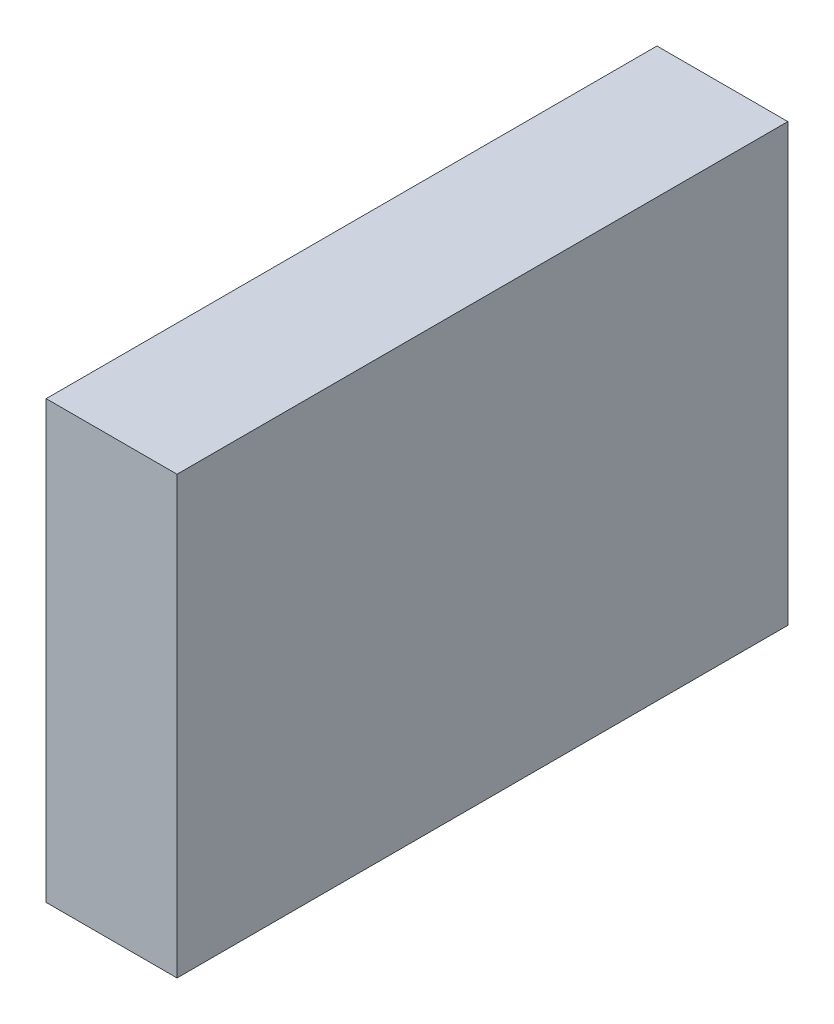
ISO-10303-21;
HEADER;
FILE_DESCRIPTION(('STEP AP214'),'2;1');
FILE_NAME('part.step','',(''),(''),'','','');
FILE_SCHEMA(('AUTOMOTIVE_DESIGN { 1 0 10303 214 1 1 1 1 }'));
ENDSEC;
DATA;
#1=APPLICATION_CONTEXT('core data for automotive mechanical design processes');
#2=APPLICATION_PROTOCOL_DEFINITION('international standard','automotive_design',2000,#1);
#3=PRODUCT_CONTEXT('',#1,'mechanical');
#4=PRODUCT('Part','Part','',(#3));
#5=PRODUCT_RELATED_PRODUCT_CATEGORY('part','',(#4));
#6=PRODUCT_DEFINITION_FORMATION('','',#4);
#7=PRODUCT_DEFINITION_CONTEXT('part definition',#1,'design');
#8=PRODUCT_DEFINITION('design','',#6,#7);
#9=PRODUCT_DEFINITION_SHAPE('','',#8);
#10=(LENGTH_UNIT() NAMED_UNIT(*) SI_UNIT(.MILLI.,.METRE.));
#11=(NAMED_UNIT(*) PLANE_ANGLE_UNIT() SI_UNIT($,.RADIAN.));
#12=(NAMED_UNIT(*) SI_UNIT($,.STERADIAN.) SOLID_ANGLE_UNIT());
#13=UNCERTAINTY_MEASURE_WITH_UNIT(LENGTH_MEASURE(1.E-05),#10,'distance_accuracy_value','');
#14=(GEOMETRIC_REPRESENTATION_CONTEXT(3) GLOBAL_UNCERTAINTY_ASSIGNED_CONTEXT((#13)) GLOBAL_UNIT_ASSIGNED_CONTEXT((#10,
#11,#12)) REPRESENTATION_CONTEXT('',''));
#15=CARTESIAN_POINT('',(0.,0.,0.));
#16=DIRECTION('',(0.,0.,1.));
#17=DIRECTION('',(1.,0.,0.));
#18=AXIS2_PLACEMENT_3D('',#15,#16,#17);
#19=CARTESIAN_POINT('',(-3.,0.679999822530764,-3.72112146154861));
#20=DIRECTION('',(1.,0.,0.));
#21=DIRECTION('',(0.,1.,8.74227765734759E-08));
#22=AXIS2_PLACEMENT_3D('',#19,#20,#21);
#23=PLANE('',#22);
#24=DIRECTION('',(0.,0.999999999999996,8.74227765733007E-08));
#25=VECTOR('',#24,1.);
#26=CARTESIAN_POINT('',(-3.,0.749999816410169,-3.65112145542901));
#27=LINE('',#26,#25);
#28=CARTESIAN_POINT('',(-3.,0.749999816411169,-3.65112145542901));
#29=VERTEX_POINT('',#28);
#30=CARTESIAN_POINT('',(-3.,1.74999981641217,-3.65112136800523));
#31=VERTEX_POINT('',#30);
#32=EDGE_CURVE('E11',#29,#31,#27,.T.);
#33=ORIENTED_EDGE('',*,*,#32,.T.);
#34=DIRECTION('',(0.,-8.74227764783136E-08,0.999999999999996));
#35=VECTOR('',#34,1.);
#36=CARTESIAN_POINT('',(-3.,1.74999981641217,-3.65112136800623));
#37=LINE('',#36,#35);
#38=CARTESIAN_POINT('',(-3.,1.74999969401928,-2.25112136800623));
#39=VERTEX_POINT('',#38);
#40=EDGE_CURVE('E69',#31,#39,#37,.T.);
#41=ORIENTED_EDGE('',*,*,#40,.T.);
#42=DIRECTION('',(0.,-0.999999999999996,-8.74227765733007E-08));
#43=VECTOR('',#42,1.);
#44=CARTESIAN_POINT('',(-3.,1.74999969402028,-2.25112136800623));
#45=LINE('',#44,#43);
#46=CARTESIAN_POINT('',(-3.,0.749999694018282,-2.25112145543001));
#47=VERTEX_POINT('',#46);
#48=EDGE_CURVE('E55',#39,#47,#45,.T.);
#49=ORIENTED_EDGE('',*,*,#48,.T.);
#50=DIRECTION('',(0.,8.74227765576152E-08,-0.999999999999996));
#51=VECTOR('',#50,1.);
#52=CARTESIAN_POINT('',(-3.,0.749999694018282,-2.25112145542901));
#53=LINE('',#52,#51);
#54=EDGE_CURVE('E53',#47,#29,#53,.T.);
#55=ORIENTED_EDGE('',*,*,#54,.T.);
#56=EDGE_LOOP('',(#33,#41,#49,#55));
#57=FACE_BOUND('',#56,.T.);
#58=ADVANCED_FACE('F17',(#57),#23,.T.);
#59=CARTESIAN_POINT('',(-3.3,0.679999822530764,-3.72112146154861));
#60=DIRECTION('',(1.,0.,0.));
#61=DIRECTION('',(0.,1.,8.74227765734759E-08));
#62=AXIS2_PLACEMENT_3D('',#59,#60,#61);
#63=PLANE('',#62);
#64=DIRECTION('',(0.,8.74227765576152E-08,-0.999999999999996));
#65=VECTOR('',#64,1.);
#66=CARTESIAN_POINT('',(-3.3,0.749999694018282,-2.25112145542901));
#67=LINE('',#66,#65);
#68=CARTESIAN_POINT('',(-3.3,0.749999694018282,-2.25112145543001));
#69=VERTEX_POINT('',#68);
#70=CARTESIAN_POINT('',(-3.3,0.749999816411169,-3.65112145542901));
#71=VERTEX_POINT('',#70);
#72=EDGE_CURVE('E24',#69,#71,#67,.T.);
#73=ORIENTED_EDGE('',*,*,#72,.F.);
#74=DIRECTION('',(0.,-0.999999999999996,-8.74227765733007E-08));
#75=VECTOR('',#74,1.);
#76=CARTESIAN_POINT('',(-3.3,1.74999969402028,-2.25112136800623));
#77=LINE('',#76,#75);
#78=CARTESIAN_POINT('',(-3.3,1.74999969401928,-2.25112136800623));
#79=VERTEX_POINT('',#78);
#80=EDGE_CURVE('E70',#79,#69,#77,.T.);
#81=ORIENTED_EDGE('',*,*,#80,.F.);
#82=DIRECTION('',(0.,-8.74227766369168E-08,0.999999999999996));
#83=VECTOR('',#82,1.);
#84=CARTESIAN_POINT('',(-3.3,1.74999981641217,-3.65112136800624));
#85=LINE('',#84,#83);
#86=CARTESIAN_POINT('',(-3.3,1.74999981641217,-3.65112136800523));
#87=VERTEX_POINT('',#86);
#88=EDGE_CURVE('E59',#87,#79,#85,.T.);
#89=ORIENTED_EDGE('',*,*,#88,.F.);
#90=DIRECTION('',(0.,0.999999999999996,8.74227765733007E-08));
#91=VECTOR('',#90,1.);
#92=CARTESIAN_POINT('',(-3.3,0.749999816410169,-3.65112145542901));
#93=LINE('',#92,#91);
#94=EDGE_CURVE('E78',#71,#87,#93,.T.);
#95=ORIENTED_EDGE('',*,*,#94,.F.);
#96=EDGE_LOOP('',(#73,#81,#89,#95));
#97=FACE_BOUND('',#96,.T.);
#98=ADVANCED_FACE('F89',(#97),#63,.F.);
#99=CARTESIAN_POINT('',(-3.,0.749999816410169,-3.65112145542901));
#100=DIRECTION('',(0.,-8.74227765734759E-08,1.));
#101=DIRECTION('',(0.,1.,8.74227765734759E-08));
#102=AXIS2_PLACEMENT_3D('',#99,#100,#101);
#103=PLANE('',#102);
#104=DIRECTION('',(-1.,0.,0.));
#105=VECTOR('',#104,1.);
#106=CARTESIAN_POINT('',(-3.,0.749999816410169,-3.65112145542901));
#107=LINE('',#106,#105);
#108=EDGE_CURVE('E65',#29,#71,#107,.T.);
#109=ORIENTED_EDGE('',*,*,#108,.T.);
#110=ORIENTED_EDGE('',*,*,#94,.T.);
#111=DIRECTION('',(-1.,0.,0.));
#112=VECTOR('',#111,1.);
#113=CARTESIAN_POINT('',(-3.,1.74999981641217,-3.65112136800624));
#114=LINE('',#113,#112);
#115=EDGE_CURVE('E66',#31,#87,#114,.T.);
#116=ORIENTED_EDGE('',*,*,#115,.F.);
#117=ORIENTED_EDGE('',*,*,#32,.F.);
#118=EDGE_LOOP('',(#109,#110,#116,#117));
#119=FACE_BOUND('',#118,.T.);
#120=ADVANCED_FACE('F63',(#119),#103,.F.);
#121=CARTESIAN_POINT('',(-3.,1.74999981641217,-3.65112136800623));
#122=DIRECTION('',(0.,-1.,-8.74227765734759E-08));
#123=DIRECTION('',(0.,-8.74227765734759E-08,1.));
#124=AXIS2_PLACEMENT_3D('',#121,#122,#123);
#125=PLANE('',#124);
#126=ORIENTED_EDGE('',*,*,#115,.T.);
#127=ORIENTED_EDGE('',*,*,#88,.T.);
#128=DIRECTION('',(-1.,0.,0.));
#129=VECTOR('',#128,1.);
#130=CARTESIAN_POINT('',(-3.,1.74999969402028,-2.25112136800623));
#131=LINE('',#130,#129);
#132=EDGE_CURVE('E60',#39,#79,#131,.T.);
#133=ORIENTED_EDGE('',*,*,#132,.F.);
#134=ORIENTED_EDGE('',*,*,#40,.F.);
#135=EDGE_LOOP('',(#126,#127,#133,#134));
#136=FACE_BOUND('',#135,.T.);
#137=ADVANCED_FACE('F91',(#136),#125,.F.);
#138=CARTESIAN_POINT('',(-3.,1.74999969402028,-2.25112136800623));
#139=DIRECTION('',(0.,8.74227765734759E-08,-1.));
#140=DIRECTION('',(0.,-1.,-8.74227765734759E-08));
#141=AXIS2_PLACEMENT_3D('',#138,#139,#140);
#142=PLANE('',#141);
#143=ORIENTED_EDGE('',*,*,#132,.T.);
#144=ORIENTED_EDGE('',*,*,#80,.T.);
#145=DIRECTION('',(-1.,0.,0.));
#146=VECTOR('',#145,1.);
#147=CARTESIAN_POINT('',(-3.,0.749999694018282,-2.25112145542901));
#148=LINE('',#147,#146);
#149=EDGE_CURVE('E84',#47,#69,#148,.T.);
#150=ORIENTED_EDGE('',*,*,#149,.F.);
#151=ORIENTED_EDGE('',*,*,#48,.F.);
#152=EDGE_LOOP('',(#143,#144,#150,#151));
#153=FACE_BOUND('',#152,.T.);
#154=ADVANCED_FACE('F86',(#153),#142,.F.);
#155=CARTESIAN_POINT('',(-3.,0.749999694018282,-2.25112145542901));
#156=DIRECTION('',(0.,1.,8.74227765734759E-08));
#157=DIRECTION('',(0.,8.74227765734759E-08,-1.));
#158=AXIS2_PLACEMENT_3D('',#155,#156,#157);
#159=PLANE('',#158);
#160=ORIENTED_EDGE('',*,*,#149,.T.);
#161=ORIENTED_EDGE('',*,*,#72,.T.);
#162=ORIENTED_EDGE('',*,*,#108,.F.);
#163=ORIENTED_EDGE('',*,*,#54,.F.);
#164=EDGE_LOOP('',(#160,#161,#162,#163));
#165=FACE_BOUND('',#164,.T.);
#166=ADVANCED_FACE('F68',(#165),#159,.F.);
#167=CLOSED_SHELL('',(#58,#98,#120,#137,#154,#166));
#168=MANIFOLD_SOLID_BREP('B1',#167);
#169=ADVANCED_BREP_SHAPE_REPRESENTATION('',(#18,#168),#14);
#170=SHAPE_DEFINITION_REPRESENTATION(#9,#169);
ENDSEC;
END-ISO-10303-21;
